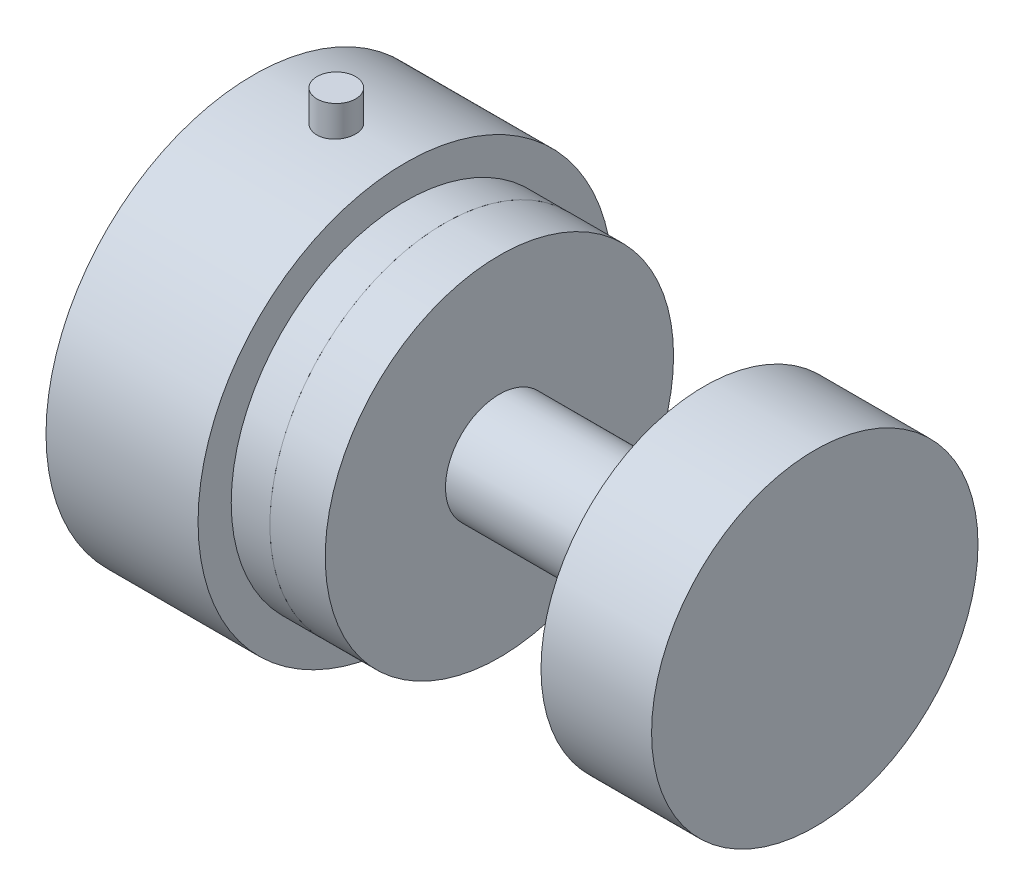
ISO-10303-21;
HEADER;
FILE_DESCRIPTION(('STEP AP214'),'2;1');
FILE_NAME('part.step','',(''),(''),'','','');
FILE_SCHEMA(('AUTOMOTIVE_DESIGN { 1 0 10303 214 1 1 1 1 }'));
ENDSEC;
DATA;
#1=APPLICATION_CONTEXT('core data for automotive mechanical design processes');
#2=APPLICATION_PROTOCOL_DEFINITION('international standard','automotive_design',2000,#1);
#3=PRODUCT_CONTEXT('',#1,'mechanical');
#4=PRODUCT('Part','Part','',(#3));
#5=PRODUCT_RELATED_PRODUCT_CATEGORY('part','',(#4));
#6=PRODUCT_DEFINITION_FORMATION('','',#4);
#7=PRODUCT_DEFINITION_CONTEXT('part definition',#1,'design');
#8=PRODUCT_DEFINITION('design','',#6,#7);
#9=PRODUCT_DEFINITION_SHAPE('','',#8);
#10=(LENGTH_UNIT() NAMED_UNIT(*) SI_UNIT(.MILLI.,.METRE.));
#11=(NAMED_UNIT(*) PLANE_ANGLE_UNIT() SI_UNIT($,.RADIAN.));
#12=(NAMED_UNIT(*) SI_UNIT($,.STERADIAN.) SOLID_ANGLE_UNIT());
#13=UNCERTAINTY_MEASURE_WITH_UNIT(LENGTH_MEASURE(1.E-05),#10,'distance_accuracy_value','');
#14=(GEOMETRIC_REPRESENTATION_CONTEXT(3) GLOBAL_UNCERTAINTY_ASSIGNED_CONTEXT((#13)) GLOBAL_UNIT_ASSIGNED_CONTEXT((#10,
#11,#12)) REPRESENTATION_CONTEXT('',''));
#15=CARTESIAN_POINT('',(0.,0.,0.));
#16=DIRECTION('',(0.,0.,1.));
#17=DIRECTION('',(1.,0.,0.));
#18=AXIS2_PLACEMENT_3D('',#15,#16,#17);
#19=CARTESIAN_POINT('',(0.,0.,0.));
#20=DIRECTION('',(-1.,0.,0.));
#21=DIRECTION('',(0.,0.,1.));
#22=AXIS2_PLACEMENT_3D('',#19,#20,#21);
#23=CYLINDRICAL_SURFACE('',#22,9.74985097192168);
#24=CARTESIAN_POINT('',(-57.0409808068153,0.,0.));
#25=DIRECTION('',(1.,0.,0.));
#26=DIRECTION('',(0.,0.,-1.));
#27=AXIS2_PLACEMENT_3D('',#24,#25,#26);
#28=CIRCLE('',#27,9.74985097192168);
#29=CARTESIAN_POINT('',(-57.0409808068153,0.,-9.74985097192168));
#30=VERTEX_POINT('',#29);
#31=EDGE_CURVE('E57',#30,#30,#28,.T.);
#32=ORIENTED_EDGE('',*,*,#31,.T.);
#33=EDGE_LOOP('',(#32));
#34=FACE_BOUND('',#33,.T.);
#35=CARTESIAN_POINT('',(-20.,0.,0.));
#36=DIRECTION('',(1.,0.,0.));
#37=DIRECTION('',(0.,0.,-1.));
#38=AXIS2_PLACEMENT_3D('',#35,#36,#37);
#39=CIRCLE('',#38,9.74985097192168);
#40=CARTESIAN_POINT('',(-20.,0.,-9.74985097192168));
#41=VERTEX_POINT('',#40);
#42=EDGE_CURVE('E11',#41,#41,#39,.T.);
#43=ORIENTED_EDGE('',*,*,#42,.F.);
#44=EDGE_LOOP('',(#43));
#45=FACE_BOUND('',#44,.T.);
#46=ADVANCED_FACE('F41',(#34,#45),#23,.T.);
#47=CARTESIAN_POINT('',(-57.0409808068153,0.,0.));
#48=DIRECTION('',(-1.,0.,0.));
#49=DIRECTION('',(0.,0.,1.));
#50=AXIS2_PLACEMENT_3D('',#47,#48,#49);
#51=CYLINDRICAL_SURFACE('',#50,31.5);
#52=CARTESIAN_POINT('',(-57.0409808068153,0.,0.));
#53=DIRECTION('',(1.,0.,0.));
#54=DIRECTION('',(0.,0.,-1.));
#55=AXIS2_PLACEMENT_3D('',#52,#53,#54);
#56=CIRCLE('',#55,31.5);
#57=CARTESIAN_POINT('',(-57.0409808068153,0.,-31.5));
#58=VERTEX_POINT('',#57);
#59=EDGE_CURVE('E48',#58,#58,#56,.T.);
#60=ORIENTED_EDGE('',*,*,#59,.F.);
#61=EDGE_LOOP('',(#60));
#62=FACE_BOUND('',#61,.T.);
#63=CARTESIAN_POINT('',(-67.0409808068153,0.,0.));
#64=DIRECTION('',(1.,0.,0.));
#65=DIRECTION('',(0.,0.,-1.));
#66=AXIS2_PLACEMENT_3D('',#63,#64,#65);
#67=CIRCLE('',#66,31.5);
#68=CARTESIAN_POINT('',(-67.0409808068153,0.,-31.5));
#69=VERTEX_POINT('',#68);
#70=EDGE_CURVE('E52',#69,#69,#67,.T.);
#71=ORIENTED_EDGE('',*,*,#70,.T.);
#72=EDGE_LOOP('',(#71));
#73=FACE_BOUND('',#72,.T.);
#74=ADVANCED_FACE('F43',(#62,#73),#51,.T.);
#75=CARTESIAN_POINT('',(-57.0409808068153,0.,0.));
#76=DIRECTION('',(1.,0.,0.));
#77=DIRECTION('',(0.,0.,-1.));
#78=AXIS2_PLACEMENT_3D('',#75,#76,#77);
#79=PLANE('',#78);
#80=ORIENTED_EDGE('',*,*,#31,.F.);
#81=EDGE_LOOP('',(#80));
#82=FACE_BOUND('',#81,.T.);
#83=ORIENTED_EDGE('',*,*,#59,.T.);
#84=EDGE_LOOP('',(#83));
#85=FACE_BOUND('',#84,.T.);
#86=ADVANCED_FACE('F89',(#82,#85),#79,.T.);
#87=CARTESIAN_POINT('',(-67.0409808068153,0.,0.));
#88=DIRECTION('',(1.,0.,0.));
#89=DIRECTION('',(0.,0.,-1.));
#90=AXIS2_PLACEMENT_3D('',#87,#88,#89);
#91=PLANE('',#90);
#92=ORIENTED_EDGE('',*,*,#70,.F.);
#93=EDGE_LOOP('',(#92));
#94=FACE_BOUND('',#93,.T.);
#95=ADVANCED_FACE('F81',(#94),#91,.F.);
#96=CARTESIAN_POINT('',(-20.,0.,0.));
#97=DIRECTION('',(1.,0.,0.));
#98=DIRECTION('',(0.,0.,-1.));
#99=AXIS2_PLACEMENT_3D('',#96,#97,#98);
#100=CYLINDRICAL_SURFACE('',#99,29.5175358893643);
#101=CARTESIAN_POINT('',(-20.,0.,0.));
#102=DIRECTION('',(1.,0.,0.));
#103=DIRECTION('',(0.,0.,-1.));
#104=AXIS2_PLACEMENT_3D('',#101,#102,#103);
#105=CIRCLE('',#104,29.5175358893643);
#106=CARTESIAN_POINT('',(-20.,0.,-29.5175358893643));
#107=VERTEX_POINT('',#106);
#108=EDGE_CURVE('E61',#107,#107,#105,.T.);
#109=ORIENTED_EDGE('',*,*,#108,.T.);
#110=EDGE_LOOP('',(#109));
#111=FACE_BOUND('',#110,.T.);
#112=CARTESIAN_POINT('',(0.,0.,0.));
#113=DIRECTION('',(1.,0.,0.));
#114=DIRECTION('',(0.,0.,-1.));
#115=AXIS2_PLACEMENT_3D('',#112,#113,#114);
#116=CIRCLE('',#115,29.5175358893643);
#117=CARTESIAN_POINT('',(0.,0.,-29.5175358893643));
#118=VERTEX_POINT('',#117);
#119=EDGE_CURVE('E62',#118,#118,#116,.T.);
#120=ORIENTED_EDGE('',*,*,#119,.F.);
#121=EDGE_LOOP('',(#120));
#122=FACE_BOUND('',#121,.T.);
#123=ADVANCED_FACE('F68',(#111,#122),#100,.T.);
#124=CARTESIAN_POINT('',(-20.,0.,0.));
#125=DIRECTION('',(1.,0.,0.));
#126=DIRECTION('',(0.,0.,-1.));
#127=AXIS2_PLACEMENT_3D('',#124,#125,#126);
#128=PLANE('',#127);
#129=ORIENTED_EDGE('',*,*,#42,.T.);
#130=EDGE_LOOP('',(#129));
#131=FACE_BOUND('',#130,.T.);
#132=ORIENTED_EDGE('',*,*,#108,.F.);
#133=EDGE_LOOP('',(#132));
#134=FACE_BOUND('',#133,.T.);
#135=ADVANCED_FACE('F71',(#131,#134),#128,.F.);
#136=CARTESIAN_POINT('',(0.,0.,0.));
#137=DIRECTION('',(1.,0.,0.));
#138=DIRECTION('',(0.,0.,-1.));
#139=AXIS2_PLACEMENT_3D('',#136,#137,#138);
#140=PLANE('',#139);
#141=ORIENTED_EDGE('',*,*,#119,.T.);
#142=EDGE_LOOP('',(#141));
#143=FACE_BOUND('',#142,.T.);
#144=ADVANCED_FACE('F73',(#143),#140,.T.);
#145=CLOSED_SHELL('',(#46,#74,#86,#95,#123,#135,#144));
#146=MANIFOLD_SOLID_BREP('B2',#145);
#147=CARTESIAN_POINT('',(-86.5409808068153,43.,0.));
#148=DIRECTION('',(0.,1.,0.));
#149=DIRECTION('',(0.,0.,1.));
#150=AXIS2_PLACEMENT_3D('',#147,#148,#149);
#151=PLANE('',#150);
#152=CARTESIAN_POINT('',(-86.5409808068153,43.,0.));
#153=DIRECTION('',(0.,-1.,0.));
#154=DIRECTION('',(0.,0.,-1.));
#155=AXIS2_PLACEMENT_3D('',#152,#153,#154);
#156=CIRCLE('',#155,3.5);
#157=CARTESIAN_POINT('',(-86.5409808068153,43.,-3.5));
#158=VERTEX_POINT('',#157);
#159=EDGE_CURVE('E156',#158,#158,#156,.T.);
#160=ORIENTED_EDGE('',*,*,#159,.F.);
#161=EDGE_LOOP('',(#160));
#162=FACE_BOUND('',#161,.T.);
#163=ADVANCED_FACE('F153',(#162),#151,.T.);
#164=CARTESIAN_POINT('',(-86.5409808068153,0.,0.));
#165=DIRECTION('',(0.,1.,0.));
#166=DIRECTION('',(0.,0.,1.));
#167=AXIS2_PLACEMENT_3D('',#164,#165,#166);
#168=PLANE('',#167);
#169=CARTESIAN_POINT('',(-86.5409808068153,0.,0.));
#170=DIRECTION('',(0.,-1.,0.));
#171=DIRECTION('',(0.,0.,-1.));
#172=AXIS2_PLACEMENT_3D('',#169,#170,#171);
#173=CIRCLE('',#172,3.5);
#174=CARTESIAN_POINT('',(-86.5409808068153,0.,-3.5));
#175=VERTEX_POINT('',#174);
#176=EDGE_CURVE('E40',#175,#175,#173,.F.);
#177=ORIENTED_EDGE('',*,*,#176,.F.);
#178=EDGE_LOOP('',(#177));
#179=FACE_BOUND('',#178,.T.);
#180=ADVANCED_FACE('F168',(#179),#168,.F.);
#181=CARTESIAN_POINT('',(-86.5409808068153,43.,0.));
#182=DIRECTION('',(0.,-1.,0.));
#183=DIRECTION('',(0.,0.,-1.));
#184=AXIS2_PLACEMENT_3D('',#181,#182,#183);
#185=CYLINDRICAL_SURFACE('',#184,3.5);
#186=ORIENTED_EDGE('',*,*,#176,.T.);
#187=EDGE_LOOP('',(#186));
#188=FACE_BOUND('',#187,.T.);
#189=ORIENTED_EDGE('',*,*,#159,.T.);
#190=EDGE_LOOP('',(#189));
#191=FACE_BOUND('',#190,.T.);
#192=ADVANCED_FACE('F165',(#188,#191),#185,.T.);
#193=CLOSED_SHELL('',(#163,#180,#192));
#194=MANIFOLD_SOLID_BREP('B6',#193);
#195=CARTESIAN_POINT('',(-77.0409808068153,0.,0.));
#196=DIRECTION('',(1.,0.,0.));
#197=DIRECTION('',(0.,0.,-1.));
#198=AXIS2_PLACEMENT_3D('',#195,#196,#197);
#199=PLANE('',#198);
#200=CARTESIAN_POINT('',(-77.0409808068153,0.,0.));
#201=DIRECTION('',(1.,0.,0.));
#202=DIRECTION('',(0.,0.,-1.));
#203=AXIS2_PLACEMENT_3D('',#200,#201,#202);
#204=CIRCLE('',#203,3.5);
#205=CARTESIAN_POINT('',(-77.0409808068153,0.,-3.5));
#206=VERTEX_POINT('',#205);
#207=EDGE_CURVE('E583',#206,#206,#204,.T.);
#208=ORIENTED_EDGE('',*,*,#207,.T.);
#209=EDGE_LOOP('',(#208));
#210=FACE_BOUND('',#209,.T.);
#211=ADVANCED_FACE('F194',(#210),#199,.T.);
#212=CARTESIAN_POINT('',(-101.540980806815,0.,0.));
#213=DIRECTION('',(1.,0.,0.));
#214=DIRECTION('',(0.,0.,-1.));
#215=AXIS2_PLACEMENT_3D('',#212,#213,#214);
#216=CYLINDRICAL_SURFACE('',#215,3.5);
#217=ORIENTED_EDGE('',*,*,#207,.F.);
#218=EDGE_LOOP('',(#217));
#219=FACE_BOUND('',#218,.T.);
#220=CARTESIAN_POINT('',(-73.0409808068153,0.,0.));
#221=DIRECTION('',(1.,0.,0.));
#222=DIRECTION('',(0.,0.,-1.));
#223=AXIS2_PLACEMENT_3D('',#220,#221,#222);
#224=CIRCLE('',#223,3.5);
#225=CARTESIAN_POINT('',(-73.0409808068153,0.,-3.5));
#226=VERTEX_POINT('',#225);
#227=EDGE_CURVE('E580',#226,#226,#224,.T.);
#228=ORIENTED_EDGE('',*,*,#227,.T.);
#229=EDGE_LOOP('',(#228));
#230=FACE_BOUND('',#229,.T.);
#231=ADVANCED_FACE('F484',(#219,#230),#216,.F.);
#232=CARTESIAN_POINT('',(-73.0409808068153,15.75,0.));
#233=DIRECTION('',(-1.,0.,0.));
#234=DIRECTION('',(0.,0.,1.));
#235=AXIS2_PLACEMENT_3D('',#232,#233,#234);
#236=PLANE('',#235);
#237=ORIENTED_EDGE('',*,*,#227,.F.);
#238=EDGE_LOOP('',(#237));
#239=FACE_BOUND('',#238,.T.);
#240=CARTESIAN_POINT('',(-73.0409808068153,0.,0.));
#241=DIRECTION('',(-1.,0.,0.));
#242=DIRECTION('',(0.,0.,1.));
#243=AXIS2_PLACEMENT_3D('',#240,#241,#242);
#244=CIRCLE('',#243,15.75);
#245=CARTESIAN_POINT('',(-73.0409808068153,0.,15.75));
#246=VERTEX_POINT('',#245);
#247=EDGE_CURVE('E262',#246,#246,#244,.F.);
#248=ORIENTED_EDGE('',*,*,#247,.T.);
#249=EDGE_LOOP('',(#248));
#250=FACE_BOUND('',#249,.T.);
#251=ADVANCED_FACE('F476',(#239,#250),#236,.F.);
#252=CARTESIAN_POINT('',(-75.0409808068735,17.6776695296636,-17.6776695296637));
#253=DIRECTION('',(1.,0.,0.));
#254=DIRECTION('',(0.,0.,-1.));
#255=AXIS2_PLACEMENT_3D('',#252,#253,#254);
#256=CONICAL_SURFACE('',#255,2.49999999979604,1.02974425839346);
#257=CARTESIAN_POINT('',(-76.5431323549688,17.6776695296636,-17.6776695295501));
#258=VERTEX_POINT('',#257);
#259=VERTEX_LOOP('',#258);
#260=FACE_BOUND('',#259,.T.);
#261=CARTESIAN_POINT('',(-75.0409808068153,17.6776695296636,-17.6776695296637));
#262=DIRECTION('',(1.,0.,0.));
#263=DIRECTION('',(0.,0.,-1.));
#264=AXIS2_PLACEMENT_3D('',#261,#262,#263);
#265=CIRCLE('',#264,2.5);
#266=CARTESIAN_POINT('',(-75.0409808068153,17.6776695296636,-20.1776695296637));
#267=VERTEX_POINT('',#266);
#268=EDGE_CURVE('E260',#267,#267,#265,.T.);
#269=ORIENTED_EDGE('',*,*,#268,.T.);
#270=EDGE_LOOP('',(#269));
#271=FACE_BOUND('',#270,.T.);
#272=ADVANCED_FACE('F468',(#260,#271),#256,.F.);
#273=CARTESIAN_POINT('',(-75.0409808068735,17.6776695296636,17.6776695296637));
#274=DIRECTION('',(1.,0.,0.));
#275=DIRECTION('',(0.,0.,-1.));
#276=AXIS2_PLACEMENT_3D('',#273,#274,#275);
#277=CONICAL_SURFACE('',#276,2.49999999997205,1.02974425866283);
#278=CARTESIAN_POINT('',(-76.5431323544573,17.6776695296636,17.6776695295473));
#279=VERTEX_POINT('',#278);
#280=VERTEX_LOOP('',#279);
#281=FACE_BOUND('',#280,.T.);
#282=CARTESIAN_POINT('',(-75.0409808068153,17.6776695296636,17.6776695296637));
#283=DIRECTION('',(1.,0.,0.));
#284=DIRECTION('',(0.,0.,-1.));
#285=AXIS2_PLACEMENT_3D('',#282,#283,#284);
#286=CIRCLE('',#285,2.5);
#287=CARTESIAN_POINT('',(-75.0409808068153,17.6776695296636,15.1776695296637));
#288=VERTEX_POINT('',#287);
#289=EDGE_CURVE('E257',#288,#288,#286,.T.);
#290=ORIENTED_EDGE('',*,*,#289,.T.);
#291=EDGE_LOOP('',(#290));
#292=FACE_BOUND('',#291,.T.);
#293=ADVANCED_FACE('F459',(#281,#292),#277,.F.);
#294=CARTESIAN_POINT('',(-75.0409808068735,-17.6776695296638,17.6776695296636));
#295=DIRECTION('',(1.,0.,0.));
#296=DIRECTION('',(0.,1.,0.));
#297=AXIS2_PLACEMENT_3D('',#294,#295,#296);
#298=CONICAL_SURFACE('',#297,2.4999999999721,1.02974425866285);
#299=CARTESIAN_POINT('',(-76.5431323544573,-17.6776695296638,17.6776695296636));
#300=VERTEX_POINT('',#299);
#301=VERTEX_LOOP('',#300);
#302=FACE_BOUND('',#301,.T.);
#303=CARTESIAN_POINT('',(-75.0409808068153,-17.6776695296638,17.6776695296636));
#304=DIRECTION('',(1.,0.,0.));
#305=DIRECTION('',(0.,0.,-1.));
#306=AXIS2_PLACEMENT_3D('',#303,#304,#305);
#307=CIRCLE('',#306,2.5);
#308=CARTESIAN_POINT('',(-75.0409808068153,-17.6776695296638,15.1776695296636));
#309=VERTEX_POINT('',#308);
#310=EDGE_CURVE('E254',#309,#309,#307,.T.);
#311=ORIENTED_EDGE('',*,*,#310,.T.);
#312=EDGE_LOOP('',(#311));
#313=FACE_BOUND('',#312,.T.);
#314=ADVANCED_FACE('F451',(#302,#313),#298,.F.);
#315=CARTESIAN_POINT('',(-75.0409808068735,-17.6776695296636,-17.6776695296639));
#316=DIRECTION('',(1.,0.,0.));
#317=DIRECTION('',(0.,0.,-1.));
#318=AXIS2_PLACEMENT_3D('',#315,#316,#317);
#319=CONICAL_SURFACE('',#318,2.49999999979593,1.02974425851373);
#320=CARTESIAN_POINT('',(-76.5431323546278,-17.6776695296636,-17.6776695295786));
#321=VERTEX_POINT('',#320);
#322=VERTEX_LOOP('',#321);
#323=FACE_BOUND('',#322,.T.);
#324=CARTESIAN_POINT('',(-75.0409808068153,-17.6776695296636,-17.6776695296639));
#325=DIRECTION('',(1.,0.,0.));
#326=DIRECTION('',(0.,0.,-1.));
#327=AXIS2_PLACEMENT_3D('',#324,#325,#326);
#328=CIRCLE('',#327,2.5);
#329=CARTESIAN_POINT('',(-75.0409808068153,-17.6776695296636,-20.1776695296638));
#330=VERTEX_POINT('',#329);
#331=EDGE_CURVE('E250',#330,#330,#328,.T.);
#332=ORIENTED_EDGE('',*,*,#331,.T.);
#333=EDGE_LOOP('',(#332));
#334=FACE_BOUND('',#333,.T.);
#335=ADVANCED_FACE('F442',(#323,#334),#319,.F.);
#336=CARTESIAN_POINT('',(-101.540980806815,0.,0.));
#337=DIRECTION('',(-1.,0.,0.));
#338=DIRECTION('',(0.,0.,1.));
#339=AXIS2_PLACEMENT_3D('',#336,#337,#338);
#340=CYLINDRICAL_SURFACE('',#339,15.75);
#341=ORIENTED_EDGE('',*,*,#247,.F.);
#342=EDGE_LOOP('',(#341));
#343=FACE_BOUND('',#342,.T.);
#344=CARTESIAN_POINT('',(-67.0409808068154,0.,0.));
#345=DIRECTION('',(-1.,0.,0.));
#346=DIRECTION('',(0.,0.,1.));
#347=AXIS2_PLACEMENT_3D('',#344,#345,#346);
#348=CIRCLE('',#347,15.75);
#349=CARTESIAN_POINT('',(-67.0409808068154,0.,15.75));
#350=VERTEX_POINT('',#349);
#351=EDGE_CURVE('E253',#350,#350,#348,.F.);
#352=ORIENTED_EDGE('',*,*,#351,.T.);
#353=EDGE_LOOP('',(#352));
#354=FACE_BOUND('',#353,.T.);
#355=ADVANCED_FACE('F433',(#343,#354),#340,.F.);
#356=CARTESIAN_POINT('',(-67.0409808068153,17.6776695296636,-17.6776695296637));
#357=DIRECTION('',(1.,0.,0.));
#358=DIRECTION('',(0.,0.,-1.));
#359=AXIS2_PLACEMENT_3D('',#356,#357,#358);
#360=CYLINDRICAL_SURFACE('',#359,2.5);
#361=ORIENTED_EDGE('',*,*,#268,.F.);
#362=EDGE_LOOP('',(#361));
#363=FACE_BOUND('',#362,.T.);
#364=CARTESIAN_POINT('',(-67.0409808068153,17.6776695296636,-17.6776695296637));
#365=DIRECTION('',(1.,0.,0.));
#366=DIRECTION('',(0.,0.,-1.));
#367=AXIS2_PLACEMENT_3D('',#364,#365,#366);
#368=CIRCLE('',#367,2.5);
#369=CARTESIAN_POINT('',(-67.0409808068153,17.6776695296636,-20.1776695296637));
#370=VERTEX_POINT('',#369);
#371=EDGE_CURVE('E573',#370,#370,#368,.T.);
#372=ORIENTED_EDGE('',*,*,#371,.T.);
#373=EDGE_LOOP('',(#372));
#374=FACE_BOUND('',#373,.T.);
#375=ADVANCED_FACE('F424',(#363,#374),#360,.F.);
#376=CARTESIAN_POINT('',(-67.0409808068153,17.6776695296636,17.6776695296637));
#377=DIRECTION('',(1.,0.,0.));
#378=DIRECTION('',(0.,0.,-1.));
#379=AXIS2_PLACEMENT_3D('',#376,#377,#378);
#380=CYLINDRICAL_SURFACE('',#379,2.5);
#381=ORIENTED_EDGE('',*,*,#289,.F.);
#382=EDGE_LOOP('',(#381));
#383=FACE_BOUND('',#382,.T.);
#384=CARTESIAN_POINT('',(-67.0409808068153,17.6776695296636,17.6776695296637));
#385=DIRECTION('',(1.,0.,0.));
#386=DIRECTION('',(0.,0.,-1.));
#387=AXIS2_PLACEMENT_3D('',#384,#385,#386);
#388=CIRCLE('',#387,2.5);
#389=CARTESIAN_POINT('',(-67.0409808068153,17.6776695296636,15.1776695296637));
#390=VERTEX_POINT('',#389);
#391=EDGE_CURVE('E570',#390,#390,#388,.T.);
#392=ORIENTED_EDGE('',*,*,#391,.T.);
#393=EDGE_LOOP('',(#392));
#394=FACE_BOUND('',#393,.T.);
#395=ADVANCED_FACE('F415',(#383,#394),#380,.F.);
#396=CARTESIAN_POINT('',(-67.0409808068153,-17.6776695296638,17.6776695296636));
#397=DIRECTION('',(1.,0.,0.));
#398=DIRECTION('',(0.,0.,-1.));
#399=AXIS2_PLACEMENT_3D('',#396,#397,#398);
#400=CYLINDRICAL_SURFACE('',#399,2.5);
#401=ORIENTED_EDGE('',*,*,#310,.F.);
#402=EDGE_LOOP('',(#401));
#403=FACE_BOUND('',#402,.T.);
#404=CARTESIAN_POINT('',(-67.0409808068153,-17.6776695296638,17.6776695296636));
#405=DIRECTION('',(1.,0.,0.));
#406=DIRECTION('',(0.,0.,-1.));
#407=AXIS2_PLACEMENT_3D('',#404,#405,#406);
#408=CIRCLE('',#407,2.5);
#409=CARTESIAN_POINT('',(-67.0409808068153,-17.6776695296638,15.1776695296636));
#410=VERTEX_POINT('',#409);
#411=EDGE_CURVE('E567',#410,#410,#408,.T.);
#412=ORIENTED_EDGE('',*,*,#411,.T.);
#413=EDGE_LOOP('',(#412));
#414=FACE_BOUND('',#413,.T.);
#415=ADVANCED_FACE('F406',(#403,#414),#400,.F.);
#416=CARTESIAN_POINT('',(-67.0409808068153,-17.6776695296636,-17.6776695296639));
#417=DIRECTION('',(1.,0.,0.));
#418=DIRECTION('',(0.,0.,-1.));
#419=AXIS2_PLACEMENT_3D('',#416,#417,#418);
#420=CYLINDRICAL_SURFACE('',#419,2.5);
#421=ORIENTED_EDGE('',*,*,#331,.F.);
#422=EDGE_LOOP('',(#421));
#423=FACE_BOUND('',#422,.T.);
#424=CARTESIAN_POINT('',(-67.0409808068153,-17.6776695296636,-17.6776695296639));
#425=DIRECTION('',(1.,0.,0.));
#426=DIRECTION('',(0.,0.,-1.));
#427=AXIS2_PLACEMENT_3D('',#424,#425,#426);
#428=CIRCLE('',#427,2.5);
#429=CARTESIAN_POINT('',(-67.0409808068153,-17.6776695296636,-20.1776695296638));
#430=VERTEX_POINT('',#429);
#431=EDGE_CURVE('E564',#430,#430,#428,.T.);
#432=ORIENTED_EDGE('',*,*,#431,.T.);
#433=EDGE_LOOP('',(#432));
#434=FACE_BOUND('',#433,.T.);
#435=ADVANCED_FACE('F397',(#423,#434),#420,.F.);
#436=CARTESIAN_POINT('',(-67.0409808068153,31.5,0.));
#437=DIRECTION('',(-1.,0.,0.));
#438=DIRECTION('',(0.,0.,1.));
#439=AXIS2_PLACEMENT_3D('',#436,#437,#438);
#440=PLANE('',#439);
#441=ORIENTED_EDGE('',*,*,#431,.F.);
#442=EDGE_LOOP('',(#441));
#443=FACE_BOUND('',#442,.T.);
#444=ORIENTED_EDGE('',*,*,#411,.F.);
#445=EDGE_LOOP('',(#444));
#446=FACE_BOUND('',#445,.T.);
#447=ORIENTED_EDGE('',*,*,#391,.F.);
#448=EDGE_LOOP('',(#447));
#449=FACE_BOUND('',#448,.T.);
#450=ORIENTED_EDGE('',*,*,#371,.F.);
#451=EDGE_LOOP('',(#450));
#452=FACE_BOUND('',#451,.T.);
#453=CARTESIAN_POINT('',(-67.0409808068153,0.,0.));
#454=DIRECTION('',(-1.,0.,0.));
#455=DIRECTION('',(0.,0.,1.));
#456=AXIS2_PLACEMENT_3D('',#453,#454,#455);
#457=CIRCLE('',#456,31.5);
#458=CARTESIAN_POINT('',(-67.0409808068153,0.,31.5));
#459=VERTEX_POINT('',#458);
#460=EDGE_CURVE('E562',#459,#459,#457,.T.);
#461=ORIENTED_EDGE('',*,*,#460,.F.);
#462=EDGE_LOOP('',(#461));
#463=FACE_BOUND('',#462,.T.);
#464=ORIENTED_EDGE('',*,*,#351,.F.);
#465=EDGE_LOOP('',(#464));
#466=FACE_BOUND('',#465,.T.);
#467=ADVANCED_FACE('F387',(#443,#446,#449,#452,#463,#466),#440,.F.);
#468=CARTESIAN_POINT('',(9.22604649794347,0.,0.));
#469=DIRECTION('',(-1.,0.,0.));
#470=DIRECTION('',(0.,0.,1.));
#471=AXIS2_PLACEMENT_3D('',#468,#469,#470);
#472=CYLINDRICAL_SURFACE('',#471,30.5);
#473=CARTESIAN_POINT('',(-86.5409808068153,30.2985148150862,-3.5));
#474=CARTESIAN_POINT('',(-86.736704998648,30.298517378201,-3.49999145726934));
#475=CARTESIAN_POINT('',(-86.9326869367584,30.3004332540409,-3.48351415691752));
#476=CARTESIAN_POINT('',(-87.3193400369835,30.3078916885357,-3.41800360986984));
#477=CARTESIAN_POINT('',(-87.5099992338935,30.3134418242641,-3.3689023422705));
#478=CARTESIAN_POINT('',(-87.8801526032251,30.3275322944483,-3.23959657868739));
#479=CARTESIAN_POINT('',(-88.0596581265395,30.3360695282893,-3.15942432520621));
#480=CARTESIAN_POINT('',(-88.4025818859251,30.3551677477307,-2.97031612135553));
#481=CARTESIAN_POINT('',(-88.5660069075798,30.3657278741277,-2.86139237549709));
#482=CARTESIAN_POINT('',(-88.8730124679545,30.3877407639857,-2.61729800992368));
#483=CARTESIAN_POINT('',(-89.0165041568806,30.3991971892655,-2.48201595110768));
#484=CARTESIAN_POINT('',(-89.2788065032114,30.4216792291987,-2.18927848624547));
#485=CARTESIAN_POINT('',(-89.3976147579643,30.4327048018289,-2.03182092416668));
#486=CARTESIAN_POINT('',(-89.6074743365064,30.4531181691266,-1.69866981088558));
#487=CARTESIAN_POINT('',(-89.6984482487189,30.4625013656716,-1.52292719050937));
#488=CARTESIAN_POINT('',(-89.8495600103249,30.4785337357317,-1.15853524249233));
#489=CARTESIAN_POINT('',(-89.9096991013859,30.4851830193348,-0.969886434909217));
#490=CARTESIAN_POINT('',(-89.9971776877525,30.4949733208849,-0.58591998239734));
#491=CARTESIAN_POINT('',(-90.0246609164593,30.498129708417,-0.390635482220915));
#492=CARTESIAN_POINT('',(-90.0464927483756,30.5006309800531,0.00179814922138868));
#493=CARTESIAN_POINT('',(-90.0408424033411,30.4999759851414,0.198947221102009));
#494=CARTESIAN_POINT('',(-89.996683409092,30.4949407964535,0.588534530467282));
#495=CARTESIAN_POINT('',(-89.9583296259024,30.4905781604075,0.780990580505139));
#496=CARTESIAN_POINT('',(-89.8500936092623,30.4786377272088,1.15671787386288));
#497=CARTESIAN_POINT('',(-89.7802105759789,30.4710598484922,1.33998888404597));
#498=CARTESIAN_POINT('',(-89.610730126278,30.4535100495338,1.69263095242608));
#499=CARTESIAN_POINT('',(-89.5110640305884,30.4435326064287,1.86196871705036));
#500=CARTESIAN_POINT('',(-89.2849052483993,30.42230250347,2.18155900020481));
#501=CARTESIAN_POINT('',(-89.1584137146432,30.4110498984224,2.33181233838803));
#502=CARTESIAN_POINT('',(-88.8813512138242,30.3884551454816,2.60986627331945));
#503=CARTESIAN_POINT('',(-88.7306499924682,30.3771128480346,2.73753708685217));
#504=CARTESIAN_POINT('',(-88.4098052390239,30.3556737708395,2.96585046369139));
#505=CARTESIAN_POINT('',(-88.2396528007264,30.3455775660804,3.06648057453255));
#506=CARTESIAN_POINT('',(-87.8845823777633,30.3277726662425,3.23784902247359));
#507=CARTESIAN_POINT('',(-87.6996477831911,30.320066705763,3.30855315570502));
#508=CARTESIAN_POINT('',(-87.3206739475028,30.3079568417157,3.41772073943063));
#509=CARTESIAN_POINT('',(-87.1266549347222,30.3035459409147,3.45625253020591));
#510=CARTESIAN_POINT('',(-86.8662650239018,30.3001908899848,3.48546347914347));
#511=CARTESIAN_POINT('',(-86.8013371230213,30.2995636448211,3.49091060261971));
#512=CARTESIAN_POINT('',(-86.6712759399713,30.2987251806388,3.49818028569412));
#513=CARTESIAN_POINT('',(-86.6061426577344,30.2985139617564,3.50000284410494));
#514=CARTESIAN_POINT('',(-86.3452566149826,30.298517378201,3.49999145726934));
#515=CARTESIAN_POINT('',(-86.1492746768723,30.3004332540409,3.48351415691752));
#516=CARTESIAN_POINT('',(-85.7626215766472,30.3078916885357,3.41800360986984));
#517=CARTESIAN_POINT('',(-85.5719623797372,30.3134418242641,3.3689023422705));
#518=CARTESIAN_POINT('',(-85.2018090104056,30.3275322944483,3.23959657868739));
#519=CARTESIAN_POINT('',(-85.0223034870912,30.3360695282893,3.1594243252062));
#520=CARTESIAN_POINT('',(-84.6793797277055,30.3551677477307,2.97031612135552));
#521=CARTESIAN_POINT('',(-84.5159547060509,30.3657278741277,2.86139237549709));
#522=CARTESIAN_POINT('',(-84.2089491456762,30.3877407639857,2.61729800992369));
#523=CARTESIAN_POINT('',(-84.0654574567501,30.3991971892655,2.48201595110769));
#524=CARTESIAN_POINT('',(-83.8031551104193,30.4216792291987,2.18927848624548));
#525=CARTESIAN_POINT('',(-83.6843468556663,30.4327048018289,2.03182092416669));
#526=CARTESIAN_POINT('',(-83.4744872771243,30.4531181691266,1.69866981088559));
#527=CARTESIAN_POINT('',(-83.3835133649118,30.4625013656716,1.52292719050938));
#528=CARTESIAN_POINT('',(-83.2324016033058,30.4785337357317,1.15853524249233));
#529=CARTESIAN_POINT('',(-83.1722625122448,30.4851830193348,0.969886434909222));
#530=CARTESIAN_POINT('',(-83.0847839258782,30.4949733208849,0.585919982397343));
#531=CARTESIAN_POINT('',(-83.0573006971713,30.498129708417,0.390635482220917));
#532=CARTESIAN_POINT('',(-83.035468865255,30.5006309800531,-0.00179814922138794));
#533=CARTESIAN_POINT('',(-83.0411192102896,30.4999759851414,-0.198947221102008));
#534=CARTESIAN_POINT('',(-83.0852782045387,30.4949407964535,-0.58853453046728));
#535=CARTESIAN_POINT('',(-83.1236319877282,30.4905781604075,-0.780990580505135));
#536=CARTESIAN_POINT('',(-83.2318680043684,30.4786377272088,-1.15671787386287));
#537=CARTESIAN_POINT('',(-83.3017510376517,30.4710598484922,-1.33998888404597));
#538=CARTESIAN_POINT('',(-83.4712314873527,30.4535100495338,-1.69263095242608));
#539=CARTESIAN_POINT('',(-83.5708975830423,30.4435326064287,-1.86196871705036));
#540=CARTESIAN_POINT('',(-83.7970563652314,30.42230250347,-2.18155900020481));
#541=CARTESIAN_POINT('',(-83.9235478989875,30.4110498984224,-2.33181233838803));
#542=CARTESIAN_POINT('',(-84.2006103998065,30.3884551454816,-2.60986627331945));
#543=CARTESIAN_POINT('',(-84.3513116211625,30.3771128480346,-2.73753708685217));
#544=CARTESIAN_POINT('',(-84.6721563746067,30.3556737708395,-2.96585046369139));
#545=CARTESIAN_POINT('',(-84.8423088129043,30.3455775660804,-3.06648057453255));
#546=CARTESIAN_POINT('',(-85.1973792358674,30.3277726662425,-3.23784902247359));
#547=CARTESIAN_POINT('',(-85.3823138304396,30.320066705763,-3.30855315570502));
#548=CARTESIAN_POINT('',(-85.7612876661279,30.3079568417157,-3.41772073943063));
#549=CARTESIAN_POINT('',(-85.9553066789085,30.3035459409147,-3.45625253020591));
#550=CARTESIAN_POINT('',(-86.2156965897289,30.3001908899848,-3.48546347914347));
#551=CARTESIAN_POINT('',(-86.2806244906094,30.2995636448211,-3.49091060261971));
#552=CARTESIAN_POINT('',(-86.4106856736594,30.2987251806388,-3.49818028569412));
#553=CARTESIAN_POINT('',(-86.4758189558962,30.2985139617564,-3.50000284410494));
#554=CARTESIAN_POINT('',(-86.5409808068153,30.2985148150862,-3.5));
#555=B_SPLINE_CURVE_WITH_KNOTS('',3,(#473,#474,#475,#476,#477,#478,#479,#480,#481,#482,#483,
#484,#485,#486,#487,#488,#489,#490,#491,#492,#493,#494,#495,#496,#497,#498,#499,#500,#501,#502,
#503,#504,#505,#506,#507,#508,#509,#510,#511,#512,#513,#514,#515,#516,#517,#518,#519,#520,#521,
#522,#523,#524,#525,#526,#527,#528,#529,#530,#531,#532,#533,#534,#535,#536,#537,#538,#539,#540,
#541,#542,#543,#544,#545,#546,#547,#548,#549,#550,#551,#552,#553,#554),.UNSPECIFIED.,.T.,.F.,(4,
2,2,2,2,2,2,2,2,2,2,2,2,2,2,2,2,2,2,2,2,2,2,2,2,2,2,2,2,2,2,2,2,2,2,2,2,2,2,2,4),(0.,
0.586924300188878,1.17507619265082,1.76261938441851,2.34991357422253,2.93974685655112,
3.52963752557404,4.1211541629619,4.71264697907599,5.301526605123,5.89038753852025,
6.47647532939777,7.06257798896398,7.65004276072638,8.23748229304951,8.82819532080956,
9.41917991237895,10.010838157074,10.6012363845076,10.7966392157224,10.9920421109474,
11.5789664111363,12.1671183035983,12.754661495366,13.34195568517,13.9317889674985,
14.5216796365215,15.1131962739093,15.7046890900234,16.2935687160704,16.8824296494677,
17.4685174403452,18.0546200999114,18.6420848716738,19.2295244039969,19.820237431757,
20.4112220233264,21.0028802680214,21.593278495455,21.7886813266698,21.9840842218949),.UNSPECIFIED.);
#556=CARTESIAN_POINT('',(-86.5409808068153,30.2985148150862,-3.5));
#557=VERTEX_POINT('',#556);
#558=EDGE_CURVE('E557',#557,#557,#555,.T.);
#559=ORIENTED_EDGE('',*,*,#558,.T.);
#560=EDGE_LOOP('',(#559));
#561=FACE_BOUND('',#560,.T.);
#562=ADVANCED_FACE('F381',(#561),#472,.T.);
#563=CARTESIAN_POINT('',(-101.540980806815,0.,0.));
#564=DIRECTION('',(-1.,0.,0.));
#565=DIRECTION('',(0.,0.,1.));
#566=AXIS2_PLACEMENT_3D('',#563,#564,#565);
#567=CYLINDRICAL_SURFACE('',#566,31.5);
#568=ORIENTED_EDGE('',*,*,#460,.T.);
#569=EDGE_LOOP('',(#568));
#570=FACE_BOUND('',#569,.T.);
#571=CARTESIAN_POINT('',(-74.0409808068153,0.,0.));
#572=DIRECTION('',(-1.,0.,0.));
#573=DIRECTION('',(0.,0.,1.));
#574=AXIS2_PLACEMENT_3D('',#571,#572,#573);
#575=CIRCLE('',#574,31.5);
#576=CARTESIAN_POINT('',(-74.0409808068153,0.,31.5));
#577=VERTEX_POINT('',#576);
#578=EDGE_CURVE('E273',#577,#577,#575,.F.);
#579=ORIENTED_EDGE('',*,*,#578,.T.);
#580=EDGE_LOOP('',(#579));
#581=FACE_BOUND('',#580,.T.);
#582=ADVANCED_FACE('F292',(#570,#581),#567,.T.);
#583=CARTESIAN_POINT('',(-86.5409808068153,37.5,0.));
#584=DIRECTION('',(0.,-1.,0.));
#585=DIRECTION('',(0.,0.,-1.));
#586=AXIS2_PLACEMENT_3D('',#583,#584,#585);
#587=CYLINDRICAL_SURFACE('',#586,3.5);
#588=ORIENTED_EDGE('',*,*,#558,.F.);
#589=EDGE_LOOP('',(#588));
#590=FACE_BOUND('',#589,.T.);
#591=CARTESIAN_POINT('',(-86.5409808068153,37.336309405189,3.5));
#592=CARTESIAN_POINT('',(-86.7369451521317,37.336311458178,3.49999159976147));
#593=CARTESIAN_POINT('',(-86.933169955734,37.3378699743436,3.48347414309542));
#594=CARTESIAN_POINT('',(-87.3203145748674,37.3439381541415,3.41779635529493));
#595=CARTESIAN_POINT('',(-87.5112223297193,37.3484540346556,3.36856725553234));
#596=CARTESIAN_POINT('',(-87.8818760486969,37.3599213532937,3.23890177151375));
#597=CARTESIAN_POINT('',(-88.0616326218252,37.3668704333545,3.15849559352669));
#598=CARTESIAN_POINT('',(-88.4050102446584,37.3824176383386,2.96881481261272));
#599=CARTESIAN_POINT('',(-88.5686383649366,37.3910150357417,2.85955293776334));
#600=CARTESIAN_POINT('',(-88.8757458661618,37.4089230033886,2.61486659417071));
#601=CARTESIAN_POINT('',(-89.0191649451733,37.4182355850682,2.47936657463364));
#602=CARTESIAN_POINT('',(-89.2812675732151,37.4365066736323,2.1862053535238));
#603=CARTESIAN_POINT('',(-89.3999488107339,37.4454651473656,2.02854208331272));
#604=CARTESIAN_POINT('',(-89.6093952653718,37.4620368979858,1.69518417705754));
#605=CARTESIAN_POINT('',(-89.7001097963598,37.4696477219285,1.51945756287205));
#606=CARTESIAN_POINT('',(-89.8507223936228,37.482645682227,1.15518511728848));
#607=CARTESIAN_POINT('',(-89.910621390417,37.4880328857272,0.966639673167975));
#608=CARTESIAN_POINT('',(-89.9977339407019,37.4959630819518,0.58266634826373));
#609=CARTESIAN_POINT('',(-90.0250427553232,37.4985143625747,0.387260253394456));
#610=CARTESIAN_POINT('',(-90.0464943633215,37.5005134027287,-0.00537773248790807));
#611=CARTESIAN_POINT('',(-90.0406378553546,37.4999612276368,-0.202609584952468));
#612=CARTESIAN_POINT('',(-89.9960027316699,37.4958223841303,-0.592651845396381));
#613=CARTESIAN_POINT('',(-89.9573268528759,37.4922451852938,-0.785474124760558));
#614=CARTESIAN_POINT('',(-89.8483101616512,37.4824692916633,-1.16188026092169));
#615=CARTESIAN_POINT('',(-89.777968693602,37.4762705425918,-1.34546392635076));
#616=CARTESIAN_POINT('',(-89.6075013357083,37.4619321209238,-1.69851073715259));
#617=CARTESIAN_POINT('',(-89.5073287334708,37.4537894082822,-1.86795119902823));
#618=CARTESIAN_POINT('',(-89.2800854886439,37.4364782470949,-2.1876388360249));
#619=CARTESIAN_POINT('',(-89.1530163926984,37.4273098575436,-2.33788711396825));
#620=CARTESIAN_POINT('',(-88.875034624526,37.4089367108281,-2.61551577028369));
#621=CARTESIAN_POINT('',(-88.7240372608983,37.3997319422155,-2.74281135319781));
#622=CARTESIAN_POINT('',(-88.4026883391404,37.3823522474711,-2.97032126317762));
#623=CARTESIAN_POINT('',(-88.2323278348931,37.3741778010752,-3.07052299956906));
#624=CARTESIAN_POINT('',(-87.8769816854713,37.359782587258,-3.24098749669501));
#625=CARTESIAN_POINT('',(-87.6919816707207,37.3535637699405,-3.3112203980125));
#626=CARTESIAN_POINT('',(-87.3129975061534,37.3438123278045,-3.419455935303));
#627=CARTESIAN_POINT('',(-87.1190333543752,37.3402740034855,-3.45752697663121));
#628=CARTESIAN_POINT('',(-86.8599836775751,37.3376175073627,-3.48602054515327));
#629=CARTESIAN_POINT('',(-86.7963043165727,37.3371279469485,-3.49125901470397));
#630=CARTESIAN_POINT('',(-86.6687528039664,37.3364735611131,-3.49825011202207));
#631=CARTESIAN_POINT('',(-86.6048806523266,37.3363087357525,-3.50000273914086));
#632=CARTESIAN_POINT('',(-86.345016461499,37.336311458178,-3.49999159976147));
#633=CARTESIAN_POINT('',(-86.1487916578967,37.3378699743436,-3.48347414309542));
#634=CARTESIAN_POINT('',(-85.7616470387632,37.3439381541415,-3.41779635529493));
#635=CARTESIAN_POINT('',(-85.5707392839114,37.3484540346556,-3.36856725553234));
#636=CARTESIAN_POINT('',(-85.2000855649338,37.3599213532937,-3.23890177151375));
#637=CARTESIAN_POINT('',(-85.0203289918055,37.3668704333545,-3.1584955935267));
#638=CARTESIAN_POINT('',(-84.6769513689723,37.3824176383386,-2.96881481261273));
#639=CARTESIAN_POINT('',(-84.5133232486941,37.3910150357417,-2.85955293776334));
#640=CARTESIAN_POINT('',(-84.2062157474689,37.4089230033886,-2.6148665941707));
#641=CARTESIAN_POINT('',(-84.0627966684574,37.4182355850682,-2.47936657463364));
#642=CARTESIAN_POINT('',(-83.8006940404156,37.4365066736323,-2.18620535352381));
#643=CARTESIAN_POINT('',(-83.6820128028968,37.4454651473656,-2.02854208331272));
#644=CARTESIAN_POINT('',(-83.4725663482589,37.4620368979858,-1.69518417705755));
#645=CARTESIAN_POINT('',(-83.3818518172709,37.4696477219285,-1.51945756287206));
#646=CARTESIAN_POINT('',(-83.2312392200079,37.482645682227,-1.15518511728849));
#647=CARTESIAN_POINT('',(-83.1713402232137,37.4880328857272,-0.966639673167979));
#648=CARTESIAN_POINT('',(-83.0842276729288,37.4959630819518,-0.58266634826373));
#649=CARTESIAN_POINT('',(-83.0569188583075,37.4985143625747,-0.387260253394459));
#650=CARTESIAN_POINT('',(-83.0354672503091,37.5005134027287,0.00537773248790295));
#651=CARTESIAN_POINT('',(-83.0413237582761,37.4999612276368,0.202609584952464));
#652=CARTESIAN_POINT('',(-83.0859588819607,37.4958223841303,0.592651845396377));
#653=CARTESIAN_POINT('',(-83.1246347607548,37.4922451852938,0.785474124760551));
#654=CARTESIAN_POINT('',(-83.2336514519795,37.4824692916633,1.16188026092168));
#655=CARTESIAN_POINT('',(-83.3039929200287,37.4762705425918,1.34546392635076));
#656=CARTESIAN_POINT('',(-83.4744602779224,37.4619321209238,1.69851073715258));
#657=CARTESIAN_POINT('',(-83.5746328801599,37.4537894082822,1.86795119902822));
#658=CARTESIAN_POINT('',(-83.8018761249867,37.4364782470949,2.18763883602489));
#659=CARTESIAN_POINT('',(-83.9289452209323,37.4273098575436,2.33788711396824));
#660=CARTESIAN_POINT('',(-84.2069269891046,37.4089367108281,2.61551577028369));
#661=CARTESIAN_POINT('',(-84.3579243527324,37.3997319422155,2.74281135319782));
#662=CARTESIAN_POINT('',(-84.6792732744902,37.3823522474711,2.97032126317762));
#663=CARTESIAN_POINT('',(-84.8496337787376,37.3741778010752,3.07052299956905));
#664=CARTESIAN_POINT('',(-85.2049799281594,37.359782587258,3.240987496695));
#665=CARTESIAN_POINT('',(-85.38997994291,37.3535637699405,3.3112203980125));
#666=CARTESIAN_POINT('',(-85.7689641074773,37.3438123278045,3.419455935303));
#667=CARTESIAN_POINT('',(-85.9629282592555,37.3402740034855,3.45752697663121));
#668=CARTESIAN_POINT('',(-86.2219779360555,37.3376175073627,3.48602054515327));
#669=CARTESIAN_POINT('',(-86.2856572970579,37.3371279469485,3.49125901470397));
#670=CARTESIAN_POINT('',(-86.4132088096643,37.3364735611131,3.49825011202207));
#671=CARTESIAN_POINT('',(-86.4770809613041,37.3363087357525,3.50000273914085));
#672=CARTESIAN_POINT('',(-86.5409808068153,37.336309405189,3.5));
#673=B_SPLINE_CURVE_WITH_KNOTS('',3,(#591,#592,#593,#594,#595,#596,#597,#598,#599,#600,#601,
#602,#603,#604,#605,#606,#607,#608,#609,#610,#611,#612,#613,#614,#615,#616,#617,#618,#619,#620,
#621,#622,#623,#624,#625,#626,#627,#628,#629,#630,#631,#632,#633,#634,#635,#636,#637,#638,#639,
#640,#641,#642,#643,#644,#645,#646,#647,#648,#649,#650,#651,#652,#653,#654,#655,#656,#657,#658,
#659,#660,#661,#662,#663,#664,#665,#666,#667,#668,#669,#670,#671,#672),.UNSPECIFIED.,.T.,.F.,(4,
2,2,2,2,2,2,2,2,2,2,2,2,2,2,2,2,2,2,2,2,2,2,2,2,2,2,2,2,2,2,2,2,2,2,2,2,2,2,2,4),(0.,
0.587649724148834,1.1765387704198,1.76485868472883,2.35291952676919,2.94269952541402,
3.53253460860345,4.12343249304264,4.71431253342717,5.30346116721983,5.89259739013869,
6.47989617052858,7.06720711117353,7.65544259808877,8.24364426856453,8.83397632780464,
9.42458224827807,10.01577525205,10.60570765334,10.7973278153648,10.9889480130453,
11.5765977371941,12.1654867834651,12.7538066977741,13.3418675398144,13.9316475384593,
14.5214826216487,15.1123805060879,15.7032605464724,16.2924091802651,16.8815454031839,
17.4688441835738,18.0561551242188,18.644390611134,19.2325922816098,19.8229243408499,
20.4135302613233,21.0047232650953,21.5946556663852,21.78627582841,21.9778960260905),.UNSPECIFIED.);
#674=CARTESIAN_POINT('',(-86.5409808068153,37.336309405189,3.5));
#675=VERTEX_POINT('',#674);
#676=EDGE_CURVE('E266',#675,#675,#673,.T.);
#677=ORIENTED_EDGE('',*,*,#676,.F.);
#678=EDGE_LOOP('',(#677));
#679=FACE_BOUND('',#678,.T.);
#680=ADVANCED_FACE('F275',(#590,#679),#587,.F.);
#681=CARTESIAN_POINT('',(-74.0409808068153,37.5,0.));
#682=DIRECTION('',(-1.,0.,0.));
#683=DIRECTION('',(0.,0.,1.));
#684=AXIS2_PLACEMENT_3D('',#681,#682,#683);
#685=PLANE('',#684);
#686=CARTESIAN_POINT('',(-74.0409808068153,0.,0.));
#687=DIRECTION('',(-1.,0.,0.));
#688=DIRECTION('',(0.,0.,1.));
#689=AXIS2_PLACEMENT_3D('',#686,#687,#688);
#690=CIRCLE('',#689,37.5);
#691=CARTESIAN_POINT('',(-74.0409808068153,0.,37.5));
#692=VERTEX_POINT('',#691);
#693=EDGE_CURVE('E203',#692,#692,#690,.T.);
#694=ORIENTED_EDGE('',*,*,#693,.F.);
#695=EDGE_LOOP('',(#694));
#696=FACE_BOUND('',#695,.T.);
#697=ORIENTED_EDGE('',*,*,#578,.F.);
#698=EDGE_LOOP('',(#697));
#699=FACE_BOUND('',#698,.T.);
#700=ADVANCED_FACE('F284',(#696,#699),#685,.F.);
#701=CARTESIAN_POINT('',(-101.540980806815,0.,0.));
#702=DIRECTION('',(-1.,0.,0.));
#703=DIRECTION('',(0.,0.,1.));
#704=AXIS2_PLACEMENT_3D('',#701,#702,#703);
#705=CYLINDRICAL_SURFACE('',#704,37.5);
#706=ORIENTED_EDGE('',*,*,#693,.T.);
#707=EDGE_LOOP('',(#706));
#708=FACE_BOUND('',#707,.T.);
#709=CARTESIAN_POINT('',(-101.540980806815,0.,0.));
#710=DIRECTION('',(-1.,0.,0.));
#711=DIRECTION('',(0.,0.,1.));
#712=AXIS2_PLACEMENT_3D('',#709,#710,#711);
#713=CIRCLE('',#712,37.5);
#714=CARTESIAN_POINT('',(-101.540980806815,0.,37.5));
#715=VERTEX_POINT('',#714);
#716=EDGE_CURVE('E151',#715,#715,#713,.F.);
#717=ORIENTED_EDGE('',*,*,#716,.T.);
#718=EDGE_LOOP('',(#717));
#719=FACE_BOUND('',#718,.T.);
#720=ORIENTED_EDGE('',*,*,#676,.T.);
#721=EDGE_LOOP('',(#720));
#722=FACE_BOUND('',#721,.T.);
#723=ADVANCED_FACE('F279',(#708,#719,#722),#705,.T.);
#724=CARTESIAN_POINT('',(-101.540980806815,37.5,0.));
#725=DIRECTION('',(1.,0.,0.));
#726=DIRECTION('',(0.,0.,-1.));
#727=AXIS2_PLACEMENT_3D('',#724,#725,#726);
#728=PLANE('',#727);
#729=ORIENTED_EDGE('',*,*,#716,.F.);
#730=EDGE_LOOP('',(#729));
#731=FACE_BOUND('',#730,.T.);
#732=ADVANCED_FACE('F283',(#731),#728,.F.);
#733=CLOSED_SHELL('',(#211,#231,#251,#272,#293,#314,#335,#355,#375,#395,#415,#435,#467,#562,
#582,#680,#700,#723,#732));
#734=CARTESIAN_POINT('',(-68.5409808068567,-22.,0.));
#735=DIRECTION('',(-1.,0.,0.));
#736=DIRECTION('',(0.,0.,1.));
#737=AXIS2_PLACEMENT_3D('',#734,#735,#736);
#738=CONICAL_SURFACE('',#737,1.25000000008413,1.0297442585817);
#739=CARTESIAN_POINT('',(-67.7899050328659,-22.,-5.6843418860808E-11));
#740=VERTEX_POINT('',#739);
#741=VERTEX_LOOP('',#740);
#742=FACE_BOUND('',#741,.T.);
#743=CARTESIAN_POINT('',(-68.5409808068153,-22.,0.));
#744=DIRECTION('',(-1.,0.,0.));
#745=DIRECTION('',(0.,0.,1.));
#746=AXIS2_PLACEMENT_3D('',#743,#744,#745);
#747=CIRCLE('',#746,1.25);
#748=CARTESIAN_POINT('',(-68.5409808068153,-22.,1.25));
#749=VERTEX_POINT('',#748);
#750=EDGE_CURVE('E246',#749,#749,#747,.T.);
#751=ORIENTED_EDGE('',*,*,#750,.T.);
#752=EDGE_LOOP('',(#751));
#753=FACE_BOUND('',#752,.T.);
#754=ADVANCED_FACE('F311',(#742,#753),#738,.F.);
#755=CARTESIAN_POINT('',(-77.0409808068153,0.,0.));
#756=DIRECTION('',(1.,0.,0.));
#757=DIRECTION('',(0.,0.,-1.));
#758=AXIS2_PLACEMENT_3D('',#755,#756,#757);
#759=PLANE('',#758);
#760=CARTESIAN_POINT('',(-77.0409808068153,-22.,0.));
#761=DIRECTION('',(-1.,0.,0.));
#762=DIRECTION('',(0.,0.,1.));
#763=AXIS2_PLACEMENT_3D('',#760,#761,#762);
#764=CIRCLE('',#763,1.25);
#765=CARTESIAN_POINT('',(-77.0409808068153,-22.,1.25));
#766=VERTEX_POINT('',#765);
#767=EDGE_CURVE('E249',#766,#766,#764,.F.);
#768=ORIENTED_EDGE('',*,*,#767,.T.);
#769=EDGE_LOOP('',(#768));
#770=FACE_BOUND('',#769,.T.);
#771=ADVANCED_FACE('F314',(#770),#759,.T.);
#772=CARTESIAN_POINT('',(-77.0409808068153,-22.,0.));
#773=DIRECTION('',(-1.,0.,0.));
#774=DIRECTION('',(0.,0.,1.));
#775=AXIS2_PLACEMENT_3D('',#772,#773,#774);
#776=CYLINDRICAL_SURFACE('',#775,1.25);
#777=ORIENTED_EDGE('',*,*,#767,.F.);
#778=EDGE_LOOP('',(#777));
#779=FACE_BOUND('',#778,.T.);
#780=ORIENTED_EDGE('',*,*,#750,.F.);
#781=EDGE_LOOP('',(#780));
#782=FACE_BOUND('',#781,.T.);
#783=ADVANCED_FACE('F321',(#779,#782),#776,.F.);
#784=CLOSED_SHELL('',(#754,#771,#783));
#785=CARTESIAN_POINT('',(-68.5409808067999,11.,-19.0525588832576));
#786=DIRECTION('',(-1.,0.,0.));
#787=DIRECTION('',(0.,0.,1.));
#788=AXIS2_PLACEMENT_3D('',#785,#786,#787);
#789=CONICAL_SURFACE('',#788,1.25000000011019,1.02974425812561);
#790=CARTESIAN_POINT('',(-67.7899050321554,11.,-19.0525588831747));
#791=VERTEX_POINT('',#790);
#792=VERTEX_LOOP('',#791);
#793=FACE_BOUND('',#792,.T.);
#794=CARTESIAN_POINT('',(-68.5409808068153,11.,-19.0525588832576));
#795=DIRECTION('',(-1.,0.,0.));
#796=DIRECTION('',(0.,0.,1.));
#797=AXIS2_PLACEMENT_3D('',#794,#795,#796);
#798=CIRCLE('',#797,1.25);
#799=CARTESIAN_POINT('',(-68.5409808068153,11.,-17.8025588832576));
#800=VERTEX_POINT('',#799);
#801=EDGE_CURVE('E241',#800,#800,#798,.T.);
#802=ORIENTED_EDGE('',*,*,#801,.T.);
#803=EDGE_LOOP('',(#802));
#804=FACE_BOUND('',#803,.T.);
#805=ADVANCED_FACE('F334',(#793,#804),#789,.F.);
#806=CARTESIAN_POINT('',(-77.0409808068153,0.,0.));
#807=DIRECTION('',(1.,0.,0.));
#808=DIRECTION('',(0.,0.,-1.));
#809=AXIS2_PLACEMENT_3D('',#806,#807,#808);
#810=PLANE('',#809);
#811=CARTESIAN_POINT('',(-77.0409808068153,11.,-19.0525588832576));
#812=DIRECTION('',(-1.,0.,0.));
#813=DIRECTION('',(0.,0.,1.));
#814=AXIS2_PLACEMENT_3D('',#811,#812,#813);
#815=CIRCLE('',#814,1.25);
#816=CARTESIAN_POINT('',(-77.0409808068153,11.,-17.8025588832576));
#817=VERTEX_POINT('',#816);
#818=EDGE_CURVE('E245',#817,#817,#815,.F.);
#819=ORIENTED_EDGE('',*,*,#818,.T.);
#820=EDGE_LOOP('',(#819));
#821=FACE_BOUND('',#820,.T.);
#822=ADVANCED_FACE('F337',(#821),#810,.T.);
#823=CARTESIAN_POINT('',(-77.0409808068153,11.,-19.0525588832576));
#824=DIRECTION('',(-1.,0.,0.));
#825=DIRECTION('',(0.,0.,1.));
#826=AXIS2_PLACEMENT_3D('',#823,#824,#825);
#827=CYLINDRICAL_SURFACE('',#826,1.25);
#828=ORIENTED_EDGE('',*,*,#818,.F.);
#829=EDGE_LOOP('',(#828));
#830=FACE_BOUND('',#829,.T.);
#831=ORIENTED_EDGE('',*,*,#801,.F.);
#832=EDGE_LOOP('',(#831));
#833=FACE_BOUND('',#832,.T.);
#834=ADVANCED_FACE('F346',(#830,#833),#827,.F.);
#835=CLOSED_SHELL('',(#805,#822,#834));
#836=CARTESIAN_POINT('',(-68.540980806743,10.9999999999998,19.0525588832578));
#837=DIRECTION('',(-1.,0.,0.));
#838=DIRECTION('',(0.,0.,1.));
#839=AXIS2_PLACEMENT_3D('',#836,#837,#838);
#840=CONICAL_SURFACE('',#839,1.25000000011476,1.02974425805527);
#841=CARTESIAN_POINT('',(-67.7899050320701,10.9999999999998,19.0525588835158));
#842=VERTEX_POINT('',#841);
#843=VERTEX_LOOP('',#842);
#844=FACE_BOUND('',#843,.T.);
#845=CARTESIAN_POINT('',(-68.5409808068153,10.9999999999998,19.0525588832578));
#846=DIRECTION('',(-1.,0.,0.));
#847=DIRECTION('',(0.,0.,1.));
#848=AXIS2_PLACEMENT_3D('',#845,#846,#847);
#849=CIRCLE('',#848,1.25);
#850=CARTESIAN_POINT('',(-68.5409808068153,10.9999999999998,20.3025588832578));
#851=VERTEX_POINT('',#850);
#852=EDGE_CURVE('E237',#851,#851,#849,.T.);
#853=ORIENTED_EDGE('',*,*,#852,.T.);
#854=EDGE_LOOP('',(#853));
#855=FACE_BOUND('',#854,.T.);
#856=ADVANCED_FACE('F228',(#844,#855),#840,.F.);
#857=CARTESIAN_POINT('',(-77.0409808068153,0.,0.));
#858=DIRECTION('',(1.,0.,0.));
#859=DIRECTION('',(0.,0.,-1.));
#860=AXIS2_PLACEMENT_3D('',#857,#858,#859);
#861=PLANE('',#860);
#862=CARTESIAN_POINT('',(-77.0409808068153,10.9999999999998,19.0525588832578));
#863=DIRECTION('',(-1.,0.,0.));
#864=DIRECTION('',(0.,0.,1.));
#865=AXIS2_PLACEMENT_3D('',#862,#863,#864);
#866=CIRCLE('',#865,1.25);
#867=CARTESIAN_POINT('',(-77.0409808068153,10.9999999999998,20.3025588832578));
#868=VERTEX_POINT('',#867);
#869=EDGE_CURVE('E197',#868,#868,#866,.F.);
#870=ORIENTED_EDGE('',*,*,#869,.T.);
#871=EDGE_LOOP('',(#870));
#872=FACE_BOUND('',#871,.T.);
#873=ADVANCED_FACE('F231',(#872),#861,.T.);
#874=CARTESIAN_POINT('',(-77.0409808068153,10.9999999999998,19.0525588832578));
#875=DIRECTION('',(-1.,0.,0.));
#876=DIRECTION('',(0.,0.,1.));
#877=AXIS2_PLACEMENT_3D('',#874,#875,#876);
#878=CYLINDRICAL_SURFACE('',#877,1.25);
#879=ORIENTED_EDGE('',*,*,#869,.F.);
#880=EDGE_LOOP('',(#879));
#881=FACE_BOUND('',#880,.T.);
#882=ORIENTED_EDGE('',*,*,#852,.F.);
#883=EDGE_LOOP('',(#882));
#884=FACE_BOUND('',#883,.T.);
#885=ADVANCED_FACE('F365',(#881,#884),#878,.F.);
#886=CLOSED_SHELL('',(#856,#873,#885));
#887=ORIENTED_CLOSED_SHELL('',*,#784,.T.);
#888=ORIENTED_CLOSED_SHELL('',*,#835,.T.);
#889=ORIENTED_CLOSED_SHELL('',*,#886,.T.);
#890=BREP_WITH_VOIDS('B35',#733,(#887,#888,#889));
#891=ADVANCED_BREP_SHAPE_REPRESENTATION('',(#18,#146,#194,#890),#14);
#892=SHAPE_DEFINITION_REPRESENTATION(#9,#891);
ENDSEC;
END-ISO-10303-21;
